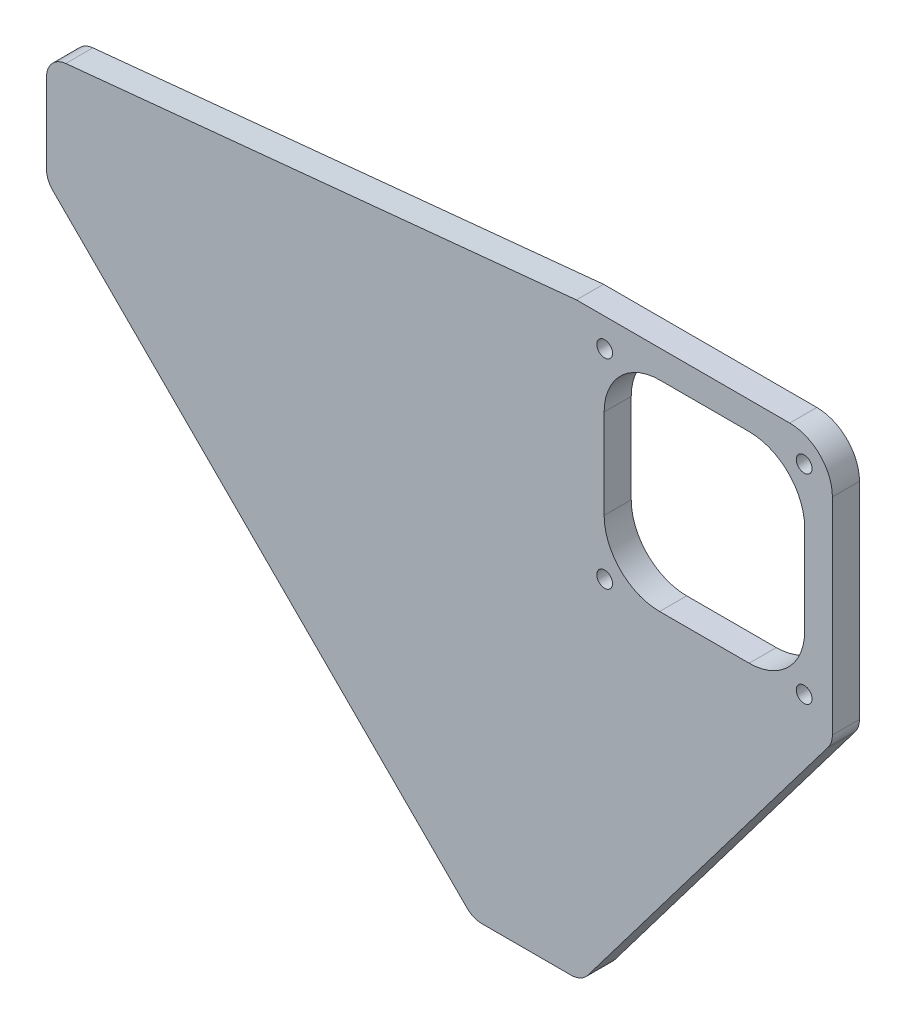
ISO-10303-21;
HEADER;
FILE_DESCRIPTION(('STEP AP214'),'2;1');
FILE_NAME('part.step','',(''),(''),'','','');
FILE_SCHEMA(('AUTOMOTIVE_DESIGN { 1 0 10303 214 1 1 1 1 }'));
ENDSEC;
DATA;
#1=APPLICATION_CONTEXT('core data for automotive mechanical design processes');
#2=APPLICATION_PROTOCOL_DEFINITION('international standard','automotive_design',2000,#1);
#3=PRODUCT_CONTEXT('',#1,'mechanical');
#4=PRODUCT('Part','Part','',(#3));
#5=PRODUCT_RELATED_PRODUCT_CATEGORY('part','',(#4));
#6=PRODUCT_DEFINITION_FORMATION('','',#4);
#7=PRODUCT_DEFINITION_CONTEXT('part definition',#1,'design');
#8=PRODUCT_DEFINITION('design','',#6,#7);
#9=PRODUCT_DEFINITION_SHAPE('','',#8);
#10=(LENGTH_UNIT() NAMED_UNIT(*) SI_UNIT(.MILLI.,.METRE.));
#11=(NAMED_UNIT(*) PLANE_ANGLE_UNIT() SI_UNIT($,.RADIAN.));
#12=(NAMED_UNIT(*) SI_UNIT($,.STERADIAN.) SOLID_ANGLE_UNIT());
#13=UNCERTAINTY_MEASURE_WITH_UNIT(LENGTH_MEASURE(1.E-05),#10,'distance_accuracy_value','');
#14=(GEOMETRIC_REPRESENTATION_CONTEXT(3) GLOBAL_UNCERTAINTY_ASSIGNED_CONTEXT((#13)) GLOBAL_UNIT_ASSIGNED_CONTEXT((#10,
#11,#12)) REPRESENTATION_CONTEXT('',''));
#15=CARTESIAN_POINT('',(0.,0.,0.));
#16=DIRECTION('',(0.,0.,1.));
#17=DIRECTION('',(1.,0.,0.));
#18=AXIS2_PLACEMENT_3D('',#15,#16,#17);
#19=CARTESIAN_POINT('',(-100.,25.4,6.35));
#20=DIRECTION('',(1.,0.,0.));
#21=DIRECTION('',(0.,0.,-1.));
#22=AXIS2_PLACEMENT_3D('',#19,#20,#21);
#23=PLANE('',#22);
#24=DIRECTION('',(0.,-1.,0.));
#25=VECTOR('',#24,1.);
#26=CARTESIAN_POINT('',(-100.,25.4,6.35));
#27=LINE('',#26,#25);
#28=CARTESIAN_POINT('',(-100.,20.8707096664379,6.35));
#29=VERTEX_POINT('',#28);
#30=CARTESIAN_POINT('',(-100.,2.07106781186547,6.35));
#31=VERTEX_POINT('',#30);
#32=EDGE_CURVE('E272',#29,#31,#27,.T.);
#33=ORIENTED_EDGE('',*,*,#32,.F.);
#34=DIRECTION('',(0.,0.,-1.));
#35=VECTOR('',#34,1.);
#36=CARTESIAN_POINT('',(-100.,20.8707096664379,6.35));
#37=LINE('',#36,#35);
#38=CARTESIAN_POINT('',(-100.,20.8707096664379,0.));
#39=VERTEX_POINT('',#38);
#40=EDGE_CURVE('E302',#29,#39,#37,.T.);
#41=ORIENTED_EDGE('',*,*,#40,.T.);
#42=DIRECTION('',(0.,-1.,0.));
#43=VECTOR('',#42,1.);
#44=CARTESIAN_POINT('',(-100.,25.4,0.));
#45=LINE('',#44,#43);
#46=CARTESIAN_POINT('',(-100.,2.07106781186547,0.));
#47=VERTEX_POINT('',#46);
#48=EDGE_CURVE('E271',#39,#47,#45,.T.);
#49=ORIENTED_EDGE('',*,*,#48,.T.);
#50=DIRECTION('',(0.,0.,-1.));
#51=VECTOR('',#50,1.);
#52=CARTESIAN_POINT('',(-100.,2.07106781186547,6.35));
#53=LINE('',#52,#51);
#54=EDGE_CURVE('E300',#47,#31,#53,.F.);
#55=ORIENTED_EDGE('',*,*,#54,.T.);
#56=EDGE_LOOP('',(#33,#41,#49,#55));
#57=FACE_BOUND('',#56,.T.);
#58=ADVANCED_FACE('F33',(#57),#23,.F.);
#59=CARTESIAN_POINT('',(-100.,0.,6.35));
#60=DIRECTION('',(0.707106781186548,0.707106781186548,0.));
#61=DIRECTION('',(-0.707106781186548,0.707106781186548,0.));
#62=AXIS2_PLACEMENT_3D('',#59,#60,#61);
#63=PLANE('',#62);
#64=DIRECTION('',(0.707106781186547,-0.707106781186547,0.));
#65=VECTOR('',#64,1.);
#66=CARTESIAN_POINT('',(-100.,0.,6.35));
#67=LINE('',#66,#65);
#68=CARTESIAN_POINT('',(-98.5355339059327,-1.46446609406727,6.35));
#69=VERTEX_POINT('',#68);
#70=CARTESIAN_POINT('',(-1.46446609406728,-98.5355339059327,6.35));
#71=VERTEX_POINT('',#70);
#72=EDGE_CURVE('E275',#69,#71,#67,.T.);
#73=ORIENTED_EDGE('',*,*,#72,.F.);
#74=DIRECTION('',(0.,0.,-1.));
#75=VECTOR('',#74,1.);
#76=CARTESIAN_POINT('',(-98.5355339059327,-1.46446609406727,6.35));
#77=LINE('',#76,#75);
#78=CARTESIAN_POINT('',(-98.5355339059327,-1.46446609406727,0.));
#79=VERTEX_POINT('',#78);
#80=EDGE_CURVE('E329',#69,#79,#77,.T.);
#81=ORIENTED_EDGE('',*,*,#80,.T.);
#82=DIRECTION('',(0.707106781186547,-0.707106781186547,0.));
#83=VECTOR('',#82,1.);
#84=CARTESIAN_POINT('',(-100.,0.,0.));
#85=LINE('',#84,#83);
#86=CARTESIAN_POINT('',(-1.46446609406728,-98.5355339059327,0.));
#87=VERTEX_POINT('',#86);
#88=EDGE_CURVE('E285',#79,#87,#85,.T.);
#89=ORIENTED_EDGE('',*,*,#88,.T.);
#90=DIRECTION('',(0.,0.,-1.));
#91=VECTOR('',#90,1.);
#92=CARTESIAN_POINT('',(-1.46446609406728,-98.5355339059327,6.35));
#93=LINE('',#92,#91);
#94=EDGE_CURVE('E327',#87,#71,#93,.F.);
#95=ORIENTED_EDGE('',*,*,#94,.T.);
#96=EDGE_LOOP('',(#73,#81,#89,#95));
#97=FACE_BOUND('',#96,.T.);
#98=ADVANCED_FACE('F372',(#97),#63,.F.);
#99=CARTESIAN_POINT('',(0.,-100.,6.35));
#100=DIRECTION('',(0.,1.,0.));
#101=DIRECTION('',(0.,0.,1.));
#102=AXIS2_PLACEMENT_3D('',#99,#100,#101);
#103=PLANE('',#102);
#104=DIRECTION('',(1.,0.,0.));
#105=VECTOR('',#104,1.);
#106=CARTESIAN_POINT('',(0.,-100.,6.35));
#107=LINE('',#106,#105);
#108=CARTESIAN_POINT('',(2.07106781186547,-100.,6.35));
#109=VERTEX_POINT('',#108);
#110=CARTESIAN_POINT('',(22.913455265881,-100.,6.35));
#111=VERTEX_POINT('',#110);
#112=EDGE_CURVE('E279',#109,#111,#107,.T.);
#113=ORIENTED_EDGE('',*,*,#112,.F.);
#114=DIRECTION('',(0.,0.,-1.));
#115=VECTOR('',#114,1.);
#116=CARTESIAN_POINT('',(2.07106781186547,-100.,6.35));
#117=LINE('',#116,#115);
#118=CARTESIAN_POINT('',(2.07106781186547,-100.,0.));
#119=VERTEX_POINT('',#118);
#120=EDGE_CURVE('E334',#109,#119,#117,.T.);
#121=ORIENTED_EDGE('',*,*,#120,.T.);
#122=DIRECTION('',(1.,0.,0.));
#123=VECTOR('',#122,1.);
#124=CARTESIAN_POINT('',(0.,-100.,0.));
#125=LINE('',#124,#123);
#126=CARTESIAN_POINT('',(22.913455265881,-100.,0.));
#127=VERTEX_POINT('',#126);
#128=EDGE_CURVE('E276',#119,#127,#125,.T.);
#129=ORIENTED_EDGE('',*,*,#128,.T.);
#130=DIRECTION('',(0.,0.,-1.));
#131=VECTOR('',#130,1.);
#132=CARTESIAN_POINT('',(22.913455265881,-100.,6.35));
#133=LINE('',#132,#131);
#134=EDGE_CURVE('E332',#127,#111,#133,.F.);
#135=ORIENTED_EDGE('',*,*,#134,.T.);
#136=EDGE_LOOP('',(#113,#121,#129,#135));
#137=FACE_BOUND('',#136,.T.);
#138=ADVANCED_FACE('F365',(#137),#103,.F.);
#139=CARTESIAN_POINT('',(0.,0.,6.35));
#140=DIRECTION('',(0.,0.,1.));
#141=DIRECTION('',(1.,0.,0.));
#142=AXIS2_PLACEMENT_3D('',#139,#140,#141);
#143=PLANE('',#142);
#144=CARTESIAN_POINT('',(77.5817279836453,-15.6782720163547,6.35));
#145=DIRECTION('',(0.,0.,-1.));
#146=DIRECTION('',(-1.,0.,0.));
#147=AXIS2_PLACEMENT_3D('',#144,#145,#146);
#148=CIRCLE('',#147,1.85);
#149=CARTESIAN_POINT('',(75.7317279836453,-15.6782720163547,6.35));
#150=VERTEX_POINT('',#149);
#151=EDGE_CURVE('E492',#150,#150,#148,.T.);
#152=ORIENTED_EDGE('',*,*,#151,.T.);
#153=EDGE_LOOP('',(#152));
#154=FACE_BOUND('',#153,.T.);
#155=CARTESIAN_POINT('',(77.5817279836453,31.0817279836453,6.35));
#156=DIRECTION('',(0.,0.,-1.));
#157=DIRECTION('',(-1.,0.,0.));
#158=AXIS2_PLACEMENT_3D('',#155,#156,#157);
#159=CIRCLE('',#158,1.85000000000001);
#160=CARTESIAN_POINT('',(75.7317279836453,31.0817279836453,6.35));
#161=VERTEX_POINT('',#160);
#162=EDGE_CURVE('E486',#161,#161,#159,.T.);
#163=ORIENTED_EDGE('',*,*,#162,.T.);
#164=EDGE_LOOP('',(#163));
#165=FACE_BOUND('',#164,.T.);
#166=CARTESIAN_POINT('',(30.8217279836453,31.0817279836453,6.35));
#167=DIRECTION('',(0.,0.,-1.));
#168=DIRECTION('',(-1.,0.,0.));
#169=AXIS2_PLACEMENT_3D('',#166,#167,#168);
#170=CIRCLE('',#169,1.85);
#171=CARTESIAN_POINT('',(28.9717279836453,31.0817279836453,6.35));
#172=VERTEX_POINT('',#171);
#173=EDGE_CURVE('E474',#172,#172,#170,.T.);
#174=ORIENTED_EDGE('',*,*,#173,.T.);
#175=EDGE_LOOP('',(#174));
#176=FACE_BOUND('',#175,.T.);
#177=CARTESIAN_POINT('',(30.8217279836453,-15.6782720163547,6.35));
#178=DIRECTION('',(0.,0.,-1.));
#179=DIRECTION('',(-1.,0.,0.));
#180=AXIS2_PLACEMENT_3D('',#177,#178,#179);
#181=CIRCLE('',#180,1.85);
#182=CARTESIAN_POINT('',(28.9717279836453,-15.6782720163547,6.35));
#183=VERTEX_POINT('',#182);
#184=EDGE_CURVE('E219',#183,#183,#181,.T.);
#185=ORIENTED_EDGE('',*,*,#184,.T.);
#186=EDGE_LOOP('',(#185));
#187=FACE_BOUND('',#186,.T.);
#188=CARTESIAN_POINT('',(43.7,-2.8,6.35));
#189=DIRECTION('',(0.,0.,1.));
#190=DIRECTION('',(1.,0.,0.));
#191=AXIS2_PLACEMENT_3D('',#188,#189,#190);
#192=CIRCLE('',#191,13.);
#193=CARTESIAN_POINT('',(30.7,-2.8,6.35));
#194=VERTEX_POINT('',#193);
#195=CARTESIAN_POINT('',(43.7,-15.8,6.35));
#196=VERTEX_POINT('',#195);
#197=EDGE_CURVE('E48',#194,#196,#192,.T.);
#198=ORIENTED_EDGE('',*,*,#197,.F.);
#199=DIRECTION('',(0.,-1.,0.));
#200=VECTOR('',#199,1.);
#201=CARTESIAN_POINT('',(30.7,18.2,6.35));
#202=LINE('',#201,#200);
#203=CARTESIAN_POINT('',(30.7,18.2,6.35));
#204=VERTEX_POINT('',#203);
#205=EDGE_CURVE('E195',#204,#194,#202,.T.);
#206=ORIENTED_EDGE('',*,*,#205,.F.);
#207=CARTESIAN_POINT('',(43.7,18.2,6.35));
#208=DIRECTION('',(0.,0.,1.));
#209=DIRECTION('',(1.,0.,0.));
#210=AXIS2_PLACEMENT_3D('',#207,#208,#209);
#211=CIRCLE('',#210,13.);
#212=CARTESIAN_POINT('',(43.7,31.2,6.35));
#213=VERTEX_POINT('',#212);
#214=EDGE_CURVE('E198',#213,#204,#211,.T.);
#215=ORIENTED_EDGE('',*,*,#214,.F.);
#216=DIRECTION('',(-1.,0.,0.));
#217=VECTOR('',#216,1.);
#218=CARTESIAN_POINT('',(43.7,31.2,6.35));
#219=LINE('',#218,#217);
#220=CARTESIAN_POINT('',(64.7,31.2,6.35));
#221=VERTEX_POINT('',#220);
#222=EDGE_CURVE('E230',#221,#213,#219,.T.);
#223=ORIENTED_EDGE('',*,*,#222,.F.);
#224=CARTESIAN_POINT('',(64.7,18.2,6.35));
#225=DIRECTION('',(0.,0.,1.));
#226=DIRECTION('',(-1.,0.,0.));
#227=AXIS2_PLACEMENT_3D('',#224,#225,#226);
#228=CIRCLE('',#227,13.);
#229=CARTESIAN_POINT('',(77.7,18.2,6.35));
#230=VERTEX_POINT('',#229);
#231=EDGE_CURVE('E227',#230,#221,#228,.T.);
#232=ORIENTED_EDGE('',*,*,#231,.F.);
#233=DIRECTION('',(0.,1.,0.));
#234=VECTOR('',#233,1.);
#235=CARTESIAN_POINT('',(77.7,18.2,6.35));
#236=LINE('',#235,#234);
#237=CARTESIAN_POINT('',(77.7,-2.8,6.35));
#238=VERTEX_POINT('',#237);
#239=EDGE_CURVE('E224',#238,#230,#236,.T.);
#240=ORIENTED_EDGE('',*,*,#239,.F.);
#241=CARTESIAN_POINT('',(64.7,-2.8,6.35));
#242=DIRECTION('',(0.,0.,1.));
#243=DIRECTION('',(1.,0.,0.));
#244=AXIS2_PLACEMENT_3D('',#241,#242,#243);
#245=CIRCLE('',#244,13.);
#246=CARTESIAN_POINT('',(64.7,-15.8,6.35));
#247=VERTEX_POINT('',#246);
#248=EDGE_CURVE('E221',#247,#238,#245,.T.);
#249=ORIENTED_EDGE('',*,*,#248,.F.);
#250=DIRECTION('',(1.,0.,0.));
#251=VECTOR('',#250,1.);
#252=CARTESIAN_POINT('',(43.7,-15.8,6.35));
#253=LINE('',#252,#251);
#254=EDGE_CURVE('E218',#196,#247,#253,.T.);
#255=ORIENTED_EDGE('',*,*,#254,.F.);
#256=EDGE_LOOP('',(#198,#206,#215,#223,#232,#240,#249,#255));
#257=FACE_BOUND('',#256,.T.);
#258=DIRECTION('',(-0.995131930887657,-0.0985517129623043,0.));
#259=VECTOR('',#258,1.);
#260=CARTESIAN_POINT('',(24.2,37.7,6.35));
#261=LINE('',#260,#259);
#262=CARTESIAN_POINT('',(24.2,37.7,6.35));
#263=VERTEX_POINT('',#262);
#264=CARTESIAN_POINT('',(-95.4927585648115,25.8463693208761,6.35));
#265=VERTEX_POINT('',#264);
#266=EDGE_CURVE('E257',#263,#265,#261,.T.);
#267=ORIENTED_EDGE('',*,*,#266,.T.);
#268=CARTESIAN_POINT('',(-95.,20.8707096664379,6.35));
#269=DIRECTION('',(0.,0.,1.));
#270=DIRECTION('',(1.,0.,0.));
#271=AXIS2_PLACEMENT_3D('',#268,#269,#270);
#272=CIRCLE('',#271,5.);
#273=EDGE_CURVE('E325',#265,#29,#272,.T.);
#274=ORIENTED_EDGE('',*,*,#273,.T.);
#275=ORIENTED_EDGE('',*,*,#32,.T.);
#276=CARTESIAN_POINT('',(-95.,2.07106781186547,6.35));
#277=DIRECTION('',(0.,0.,1.));
#278=DIRECTION('',(1.,0.,0.));
#279=AXIS2_PLACEMENT_3D('',#276,#277,#278);
#280=CIRCLE('',#279,5.);
#281=EDGE_CURVE('E323',#31,#69,#280,.T.);
#282=ORIENTED_EDGE('',*,*,#281,.T.);
#283=ORIENTED_EDGE('',*,*,#72,.T.);
#284=CARTESIAN_POINT('',(2.07106781186547,-95.,6.35));
#285=DIRECTION('',(0.,0.,1.));
#286=DIRECTION('',(1.,0.,0.));
#287=AXIS2_PLACEMENT_3D('',#284,#285,#286);
#288=CIRCLE('',#287,5.);
#289=EDGE_CURVE('E321',#71,#109,#288,.T.);
#290=ORIENTED_EDGE('',*,*,#289,.T.);
#291=ORIENTED_EDGE('',*,*,#112,.T.);
#292=CARTESIAN_POINT('',(22.913455265881,-95.,6.35));
#293=DIRECTION('',(0.,0.,1.));
#294=DIRECTION('',(1.,0.,0.));
#295=AXIS2_PLACEMENT_3D('',#292,#293,#294);
#296=CIRCLE('',#295,5.);
#297=CARTESIAN_POINT('',(26.9004871938926,-98.0172133509277,6.35));
#298=VERTEX_POINT('',#297);
#299=EDGE_CURVE('E319',#111,#298,#296,.T.);
#300=ORIENTED_EDGE('',*,*,#299,.T.);
#301=DIRECTION('',(0.603442670185537,0.797406385602316,0.));
#302=VECTOR('',#301,1.);
#303=CARTESIAN_POINT('',(84.2,-22.3,6.35));
#304=LINE('',#303,#302);
#305=CARTESIAN_POINT('',(83.1870319280116,-23.6385649522704,6.35));
#306=VERTEX_POINT('',#305);
#307=EDGE_CURVE('E249',#298,#306,#304,.T.);
#308=ORIENTED_EDGE('',*,*,#307,.T.);
#309=CARTESIAN_POINT('',(79.2,-20.6213516013427,6.35));
#310=DIRECTION('',(0.,0.,1.));
#311=DIRECTION('',(1.,0.,0.));
#312=AXIS2_PLACEMENT_3D('',#309,#310,#311);
#313=CIRCLE('',#312,5.);
#314=CARTESIAN_POINT('',(84.2,-20.6213516013427,6.35));
#315=VERTEX_POINT('',#314);
#316=EDGE_CURVE('E317',#306,#315,#313,.T.);
#317=ORIENTED_EDGE('',*,*,#316,.T.);
#318=DIRECTION('',(0.,1.,0.));
#319=VECTOR('',#318,1.);
#320=CARTESIAN_POINT('',(84.2,37.7,6.35));
#321=LINE('',#320,#319);
#322=CARTESIAN_POINT('',(84.2,27.7,6.35));
#323=VERTEX_POINT('',#322);
#324=EDGE_CURVE('E252',#315,#323,#321,.T.);
#325=ORIENTED_EDGE('',*,*,#324,.T.);
#326=CARTESIAN_POINT('',(74.2,27.7,6.35));
#327=DIRECTION('',(0.,0.,1.));
#328=DIRECTION('',(1.,0.,0.));
#329=AXIS2_PLACEMENT_3D('',#326,#327,#328);
#330=CIRCLE('',#329,10.);
#331=CARTESIAN_POINT('',(74.2,37.7,6.35));
#332=VERTEX_POINT('',#331);
#333=EDGE_CURVE('E298',#323,#332,#330,.T.);
#334=ORIENTED_EDGE('',*,*,#333,.T.);
#335=DIRECTION('',(-1.,0.,0.));
#336=VECTOR('',#335,1.);
#337=CARTESIAN_POINT('',(24.2,37.7,6.35));
#338=LINE('',#337,#336);
#339=EDGE_CURVE('E255',#332,#263,#338,.T.);
#340=ORIENTED_EDGE('',*,*,#339,.T.);
#341=EDGE_LOOP('',(#267,#274,#275,#282,#283,#290,#291,#300,#308,#317,#325,#334,#340));
#342=FACE_BOUND('',#341,.T.);
#343=ADVANCED_FACE('F359',(#154,#165,#176,#187,#257,#342),#143,.T.);
#344=CARTESIAN_POINT('',(0.,0.,0.));
#345=DIRECTION('',(0.,0.,1.));
#346=DIRECTION('',(1.,0.,0.));
#347=AXIS2_PLACEMENT_3D('',#344,#345,#346);
#348=PLANE('',#347);
#349=CARTESIAN_POINT('',(77.5817279836453,-15.6782720163547,0.));
#350=DIRECTION('',(0.,0.,-1.));
#351=DIRECTION('',(-1.,0.,0.));
#352=AXIS2_PLACEMENT_3D('',#349,#350,#351);
#353=CIRCLE('',#352,1.85);
#354=CARTESIAN_POINT('',(75.7317279836453,-15.6782720163547,0.));
#355=VERTEX_POINT('',#354);
#356=EDGE_CURVE('E489',#355,#355,#353,.T.);
#357=ORIENTED_EDGE('',*,*,#356,.F.);
#358=EDGE_LOOP('',(#357));
#359=FACE_BOUND('',#358,.T.);
#360=CARTESIAN_POINT('',(77.5817279836453,31.0817279836453,0.));
#361=DIRECTION('',(0.,0.,-1.));
#362=DIRECTION('',(-1.,0.,0.));
#363=AXIS2_PLACEMENT_3D('',#360,#361,#362);
#364=CIRCLE('',#363,1.85000000000001);
#365=CARTESIAN_POINT('',(75.7317279836453,31.0817279836453,0.));
#366=VERTEX_POINT('',#365);
#367=EDGE_CURVE('E481',#366,#366,#364,.T.);
#368=ORIENTED_EDGE('',*,*,#367,.F.);
#369=EDGE_LOOP('',(#368));
#370=FACE_BOUND('',#369,.T.);
#371=CARTESIAN_POINT('',(30.8217279836453,31.0817279836453,0.));
#372=DIRECTION('',(0.,0.,-1.));
#373=DIRECTION('',(-1.,0.,0.));
#374=AXIS2_PLACEMENT_3D('',#371,#372,#373);
#375=CIRCLE('',#374,1.85);
#376=CARTESIAN_POINT('',(28.9717279836453,31.0817279836453,0.));
#377=VERTEX_POINT('',#376);
#378=EDGE_CURVE('E477',#377,#377,#375,.T.);
#379=ORIENTED_EDGE('',*,*,#378,.F.);
#380=EDGE_LOOP('',(#379));
#381=FACE_BOUND('',#380,.T.);
#382=CARTESIAN_POINT('',(30.8217279836453,-15.6782720163547,0.));
#383=DIRECTION('',(0.,0.,-1.));
#384=DIRECTION('',(-1.,0.,0.));
#385=AXIS2_PLACEMENT_3D('',#382,#383,#384);
#386=CIRCLE('',#385,1.85);
#387=CARTESIAN_POINT('',(28.9717279836453,-15.6782720163547,0.));
#388=VERTEX_POINT('',#387);
#389=EDGE_CURVE('E201',#388,#388,#386,.T.);
#390=ORIENTED_EDGE('',*,*,#389,.F.);
#391=EDGE_LOOP('',(#390));
#392=FACE_BOUND('',#391,.T.);
#393=DIRECTION('',(0.,-1.,0.));
#394=VECTOR('',#393,1.);
#395=CARTESIAN_POINT('',(30.7,18.2,0.));
#396=LINE('',#395,#394);
#397=CARTESIAN_POINT('',(30.7,18.2,0.));
#398=VERTEX_POINT('',#397);
#399=CARTESIAN_POINT('',(30.7,-2.8,0.));
#400=VERTEX_POINT('',#399);
#401=EDGE_CURVE('E184',#398,#400,#396,.T.);
#402=ORIENTED_EDGE('',*,*,#401,.T.);
#403=CARTESIAN_POINT('',(43.7,-2.8,0.));
#404=DIRECTION('',(0.,0.,1.));
#405=DIRECTION('',(1.,0.,0.));
#406=AXIS2_PLACEMENT_3D('',#403,#404,#405);
#407=CIRCLE('',#406,13.);
#408=CARTESIAN_POINT('',(43.7,-15.8,0.));
#409=VERTEX_POINT('',#408);
#410=EDGE_CURVE('E178',#400,#409,#407,.T.);
#411=ORIENTED_EDGE('',*,*,#410,.T.);
#412=DIRECTION('',(1.,0.,0.));
#413=VECTOR('',#412,1.);
#414=CARTESIAN_POINT('',(43.7,-15.8,0.));
#415=LINE('',#414,#413);
#416=CARTESIAN_POINT('',(64.7,-15.8,0.));
#417=VERTEX_POINT('',#416);
#418=EDGE_CURVE('E187',#409,#417,#415,.T.);
#419=ORIENTED_EDGE('',*,*,#418,.T.);
#420=CARTESIAN_POINT('',(64.7,-2.8,0.));
#421=DIRECTION('',(0.,0.,1.));
#422=DIRECTION('',(1.,0.,0.));
#423=AXIS2_PLACEMENT_3D('',#420,#421,#422);
#424=CIRCLE('',#423,13.);
#425=CARTESIAN_POINT('',(77.7,-2.8,0.));
#426=VERTEX_POINT('',#425);
#427=EDGE_CURVE('E56',#417,#426,#424,.T.);
#428=ORIENTED_EDGE('',*,*,#427,.T.);
#429=DIRECTION('',(0.,1.,0.));
#430=VECTOR('',#429,1.);
#431=CARTESIAN_POINT('',(77.7,18.2,0.));
#432=LINE('',#431,#430);
#433=CARTESIAN_POINT('',(77.7,18.2,0.));
#434=VERTEX_POINT('',#433);
#435=EDGE_CURVE('E205',#426,#434,#432,.T.);
#436=ORIENTED_EDGE('',*,*,#435,.T.);
#437=CARTESIAN_POINT('',(64.7,18.2,0.));
#438=DIRECTION('',(0.,0.,1.));
#439=DIRECTION('',(-1.,0.,0.));
#440=AXIS2_PLACEMENT_3D('',#437,#438,#439);
#441=CIRCLE('',#440,13.);
#442=CARTESIAN_POINT('',(64.7,31.2,0.));
#443=VERTEX_POINT('',#442);
#444=EDGE_CURVE('E208',#434,#443,#441,.T.);
#445=ORIENTED_EDGE('',*,*,#444,.T.);
#446=DIRECTION('',(-1.,0.,0.));
#447=VECTOR('',#446,1.);
#448=CARTESIAN_POINT('',(43.7,31.2,0.));
#449=LINE('',#448,#447);
#450=CARTESIAN_POINT('',(43.7,31.2,0.));
#451=VERTEX_POINT('',#450);
#452=EDGE_CURVE('E211',#443,#451,#449,.T.);
#453=ORIENTED_EDGE('',*,*,#452,.T.);
#454=CARTESIAN_POINT('',(43.7,18.2,0.));
#455=DIRECTION('',(0.,0.,1.));
#456=DIRECTION('',(1.,0.,0.));
#457=AXIS2_PLACEMENT_3D('',#454,#455,#456);
#458=CIRCLE('',#457,13.);
#459=EDGE_CURVE('E214',#451,#398,#458,.T.);
#460=ORIENTED_EDGE('',*,*,#459,.T.);
#461=EDGE_LOOP('',(#402,#411,#419,#428,#436,#445,#453,#460));
#462=FACE_BOUND('',#461,.T.);
#463=ORIENTED_EDGE('',*,*,#48,.F.);
#464=CARTESIAN_POINT('',(-95.,20.8707096664379,0.));
#465=DIRECTION('',(0.,0.,1.));
#466=DIRECTION('',(1.,0.,0.));
#467=AXIS2_PLACEMENT_3D('',#464,#465,#466);
#468=CIRCLE('',#467,5.);
#469=CARTESIAN_POINT('',(-95.4927585648115,25.8463693208761,0.));
#470=VERTEX_POINT('',#469);
#471=EDGE_CURVE('E313',#39,#470,#468,.F.);
#472=ORIENTED_EDGE('',*,*,#471,.T.);
#473=DIRECTION('',(-0.995131930887657,-0.0985517129623043,0.));
#474=VECTOR('',#473,1.);
#475=CARTESIAN_POINT('',(24.2,37.7,0.));
#476=LINE('',#475,#474);
#477=CARTESIAN_POINT('',(24.2,37.7,0.));
#478=VERTEX_POINT('',#477);
#479=EDGE_CURVE('E253',#478,#470,#476,.T.);
#480=ORIENTED_EDGE('',*,*,#479,.F.);
#481=DIRECTION('',(-1.,0.,0.));
#482=VECTOR('',#481,1.);
#483=CARTESIAN_POINT('',(24.2,37.7,0.));
#484=LINE('',#483,#482);
#485=CARTESIAN_POINT('',(74.2,37.7,0.));
#486=VERTEX_POINT('',#485);
#487=EDGE_CURVE('E265',#486,#478,#484,.T.);
#488=ORIENTED_EDGE('',*,*,#487,.F.);
#489=CARTESIAN_POINT('',(74.2,27.7,0.));
#490=DIRECTION('',(0.,0.,1.));
#491=DIRECTION('',(1.,0.,0.));
#492=AXIS2_PLACEMENT_3D('',#489,#490,#491);
#493=CIRCLE('',#492,10.);
#494=CARTESIAN_POINT('',(84.2,27.7,0.));
#495=VERTEX_POINT('',#494);
#496=EDGE_CURVE('E292',#486,#495,#493,.F.);
#497=ORIENTED_EDGE('',*,*,#496,.T.);
#498=DIRECTION('',(0.,1.,0.));
#499=VECTOR('',#498,1.);
#500=CARTESIAN_POINT('',(84.2,37.7,0.));
#501=LINE('',#500,#499);
#502=CARTESIAN_POINT('',(84.2,-20.6213516013427,0.));
#503=VERTEX_POINT('',#502);
#504=EDGE_CURVE('E263',#503,#495,#501,.T.);
#505=ORIENTED_EDGE('',*,*,#504,.F.);
#506=CARTESIAN_POINT('',(79.2,-20.6213516013427,0.));
#507=DIRECTION('',(0.,0.,1.));
#508=DIRECTION('',(1.,0.,0.));
#509=AXIS2_PLACEMENT_3D('',#506,#507,#508);
#510=CIRCLE('',#509,5.);
#511=CARTESIAN_POINT('',(83.1870319280116,-23.6385649522704,0.));
#512=VERTEX_POINT('',#511);
#513=EDGE_CURVE('E305',#503,#512,#510,.F.);
#514=ORIENTED_EDGE('',*,*,#513,.T.);
#515=DIRECTION('',(0.603442670185537,0.797406385602316,0.));
#516=VECTOR('',#515,1.);
#517=CARTESIAN_POINT('',(84.2,-22.3,0.));
#518=LINE('',#517,#516);
#519=CARTESIAN_POINT('',(26.9004871938926,-98.0172133509277,0.));
#520=VERTEX_POINT('',#519);
#521=EDGE_CURVE('E237',#520,#512,#518,.T.);
#522=ORIENTED_EDGE('',*,*,#521,.F.);
#523=CARTESIAN_POINT('',(22.913455265881,-95.,0.));
#524=DIRECTION('',(0.,0.,1.));
#525=DIRECTION('',(1.,0.,0.));
#526=AXIS2_PLACEMENT_3D('',#523,#524,#525);
#527=CIRCLE('',#526,5.);
#528=EDGE_CURVE('E307',#520,#127,#527,.F.);
#529=ORIENTED_EDGE('',*,*,#528,.T.);
#530=ORIENTED_EDGE('',*,*,#128,.F.);
#531=CARTESIAN_POINT('',(2.07106781186547,-95.,0.));
#532=DIRECTION('',(0.,0.,1.));
#533=DIRECTION('',(1.,0.,0.));
#534=AXIS2_PLACEMENT_3D('',#531,#532,#533);
#535=CIRCLE('',#534,5.);
#536=EDGE_CURVE('E309',#119,#87,#535,.F.);
#537=ORIENTED_EDGE('',*,*,#536,.T.);
#538=ORIENTED_EDGE('',*,*,#88,.F.);
#539=CARTESIAN_POINT('',(-95.,2.07106781186547,0.));
#540=DIRECTION('',(0.,0.,1.));
#541=DIRECTION('',(1.,0.,0.));
#542=AXIS2_PLACEMENT_3D('',#539,#540,#541);
#543=CIRCLE('',#542,5.);
#544=EDGE_CURVE('E311',#79,#47,#543,.F.);
#545=ORIENTED_EDGE('',*,*,#544,.T.);
#546=EDGE_LOOP('',(#463,#472,#480,#488,#497,#505,#514,#522,#529,#530,#537,#538,#545));
#547=FACE_BOUND('',#546,.T.);
#548=ADVANCED_FACE('F191',(#359,#370,#381,#392,#462,#547),#348,.F.);
#549=CARTESIAN_POINT('',(84.2,-22.3,6.35));
#550=DIRECTION('',(-0.797406385602316,0.603442670185536,0.));
#551=DIRECTION('',(-0.603442670185537,-0.797406385602316,0.));
#552=AXIS2_PLACEMENT_3D('',#549,#550,#551);
#553=PLANE('',#552);
#554=ORIENTED_EDGE('',*,*,#307,.F.);
#555=DIRECTION('',(0.,0.,-1.));
#556=VECTOR('',#555,1.);
#557=CARTESIAN_POINT('',(26.9004871938926,-98.0172133509277,6.35));
#558=LINE('',#557,#556);
#559=EDGE_CURVE('E41',#298,#520,#558,.T.);
#560=ORIENTED_EDGE('',*,*,#559,.T.);
#561=ORIENTED_EDGE('',*,*,#521,.T.);
#562=DIRECTION('',(0.,0.,-1.));
#563=VECTOR('',#562,1.);
#564=CARTESIAN_POINT('',(83.1870319280116,-23.6385649522704,6.35));
#565=LINE('',#564,#563);
#566=EDGE_CURVE('E337',#512,#306,#565,.F.);
#567=ORIENTED_EDGE('',*,*,#566,.T.);
#568=EDGE_LOOP('',(#554,#560,#561,#567));
#569=FACE_BOUND('',#568,.T.);
#570=ADVANCED_FACE('F343',(#569),#553,.F.);
#571=CARTESIAN_POINT('',(84.2,37.7,6.35));
#572=DIRECTION('',(-1.,0.,0.));
#573=DIRECTION('',(0.,-1.,0.));
#574=AXIS2_PLACEMENT_3D('',#571,#572,#573);
#575=PLANE('',#574);
#576=ORIENTED_EDGE('',*,*,#324,.F.);
#577=DIRECTION('',(0.,0.,-1.));
#578=VECTOR('',#577,1.);
#579=CARTESIAN_POINT('',(84.2,-20.6213516013427,6.35));
#580=LINE('',#579,#578);
#581=EDGE_CURVE('E11',#315,#503,#580,.T.);
#582=ORIENTED_EDGE('',*,*,#581,.T.);
#583=ORIENTED_EDGE('',*,*,#504,.T.);
#584=DIRECTION('',(0.,0.,-1.));
#585=VECTOR('',#584,1.);
#586=CARTESIAN_POINT('',(84.2,27.7,6.35));
#587=LINE('',#586,#585);
#588=EDGE_CURVE('E295',#495,#323,#587,.F.);
#589=ORIENTED_EDGE('',*,*,#588,.T.);
#590=EDGE_LOOP('',(#576,#582,#583,#589));
#591=FACE_BOUND('',#590,.T.);
#592=ADVANCED_FACE('F355',(#591),#575,.F.);
#593=CARTESIAN_POINT('',(24.2,37.7,6.35));
#594=DIRECTION('',(0.,-1.,0.));
#595=DIRECTION('',(1.,0.,0.));
#596=AXIS2_PLACEMENT_3D('',#593,#594,#595);
#597=PLANE('',#596);
#598=ORIENTED_EDGE('',*,*,#339,.F.);
#599=DIRECTION('',(0.,0.,-1.));
#600=VECTOR('',#599,1.);
#601=CARTESIAN_POINT('',(74.2,37.7,6.35));
#602=LINE('',#601,#600);
#603=EDGE_CURVE('E282',#332,#486,#602,.T.);
#604=ORIENTED_EDGE('',*,*,#603,.T.);
#605=ORIENTED_EDGE('',*,*,#487,.T.);
#606=DIRECTION('',(0.,0.,-1.));
#607=VECTOR('',#606,1.);
#608=CARTESIAN_POINT('',(24.2,37.7,6.35));
#609=LINE('',#608,#607);
#610=EDGE_CURVE('E260',#263,#478,#609,.T.);
#611=ORIENTED_EDGE('',*,*,#610,.F.);
#612=EDGE_LOOP('',(#598,#604,#605,#611));
#613=FACE_BOUND('',#612,.T.);
#614=ADVANCED_FACE('F394',(#613),#597,.F.);
#615=CARTESIAN_POINT('',(24.2,37.7,6.35));
#616=DIRECTION('',(0.0985517129623043,-0.995131930887657,0.));
#617=DIRECTION('',(0.995131930887657,0.0985517129623043,0.));
#618=AXIS2_PLACEMENT_3D('',#615,#616,#617);
#619=PLANE('',#618);
#620=ORIENTED_EDGE('',*,*,#479,.T.);
#621=DIRECTION('',(0.,0.,-1.));
#622=VECTOR('',#621,1.);
#623=CARTESIAN_POINT('',(-95.4927585648115,25.8463693208761,6.35));
#624=LINE('',#623,#622);
#625=EDGE_CURVE('E315',#470,#265,#624,.F.);
#626=ORIENTED_EDGE('',*,*,#625,.T.);
#627=ORIENTED_EDGE('',*,*,#266,.F.);
#628=ORIENTED_EDGE('',*,*,#610,.T.);
#629=EDGE_LOOP('',(#620,#626,#627,#628));
#630=FACE_BOUND('',#629,.T.);
#631=ADVANCED_FACE('F390',(#630),#619,.F.);
#632=CARTESIAN_POINT('',(74.2,27.7,6.35));
#633=DIRECTION('',(0.,0.,-1.));
#634=DIRECTION('',(-1.,0.,0.));
#635=AXIS2_PLACEMENT_3D('',#632,#633,#634);
#636=CYLINDRICAL_SURFACE('',#635,10.);
#637=ORIENTED_EDGE('',*,*,#333,.F.);
#638=ORIENTED_EDGE('',*,*,#588,.F.);
#639=ORIENTED_EDGE('',*,*,#496,.F.);
#640=ORIENTED_EDGE('',*,*,#603,.F.);
#641=EDGE_LOOP('',(#637,#638,#639,#640));
#642=FACE_BOUND('',#641,.T.);
#643=ADVANCED_FACE('F397',(#642),#636,.T.);
#644=CARTESIAN_POINT('',(-95.,20.8707096664379,6.35));
#645=DIRECTION('',(0.,0.,-1.));
#646=DIRECTION('',(-1.,0.,0.));
#647=AXIS2_PLACEMENT_3D('',#644,#645,#646);
#648=CYLINDRICAL_SURFACE('',#647,5.);
#649=ORIENTED_EDGE('',*,*,#273,.F.);
#650=ORIENTED_EDGE('',*,*,#625,.F.);
#651=ORIENTED_EDGE('',*,*,#471,.F.);
#652=ORIENTED_EDGE('',*,*,#40,.F.);
#653=EDGE_LOOP('',(#649,#650,#651,#652));
#654=FACE_BOUND('',#653,.T.);
#655=ADVANCED_FACE('F385',(#654),#648,.T.);
#656=CARTESIAN_POINT('',(-95.,2.07106781186547,6.35));
#657=DIRECTION('',(0.,0.,-1.));
#658=DIRECTION('',(-1.,0.,0.));
#659=AXIS2_PLACEMENT_3D('',#656,#657,#658);
#660=CYLINDRICAL_SURFACE('',#659,5.);
#661=ORIENTED_EDGE('',*,*,#281,.F.);
#662=ORIENTED_EDGE('',*,*,#54,.F.);
#663=ORIENTED_EDGE('',*,*,#544,.F.);
#664=ORIENTED_EDGE('',*,*,#80,.F.);
#665=EDGE_LOOP('',(#661,#662,#663,#664));
#666=FACE_BOUND('',#665,.T.);
#667=ADVANCED_FACE('F378',(#666),#660,.T.);
#668=CARTESIAN_POINT('',(2.07106781186547,-95.,6.35));
#669=DIRECTION('',(0.,0.,-1.));
#670=DIRECTION('',(-1.,0.,0.));
#671=AXIS2_PLACEMENT_3D('',#668,#669,#670);
#672=CYLINDRICAL_SURFACE('',#671,5.);
#673=ORIENTED_EDGE('',*,*,#289,.F.);
#674=ORIENTED_EDGE('',*,*,#94,.F.);
#675=ORIENTED_EDGE('',*,*,#536,.F.);
#676=ORIENTED_EDGE('',*,*,#120,.F.);
#677=EDGE_LOOP('',(#673,#674,#675,#676));
#678=FACE_BOUND('',#677,.T.);
#679=ADVANCED_FACE('F375',(#678),#672,.T.);
#680=CARTESIAN_POINT('',(22.913455265881,-95.,6.35));
#681=DIRECTION('',(0.,0.,-1.));
#682=DIRECTION('',(-1.,0.,0.));
#683=AXIS2_PLACEMENT_3D('',#680,#681,#682);
#684=CYLINDRICAL_SURFACE('',#683,5.);
#685=ORIENTED_EDGE('',*,*,#299,.F.);
#686=ORIENTED_EDGE('',*,*,#134,.F.);
#687=ORIENTED_EDGE('',*,*,#528,.F.);
#688=ORIENTED_EDGE('',*,*,#559,.F.);
#689=EDGE_LOOP('',(#685,#686,#687,#688));
#690=FACE_BOUND('',#689,.T.);
#691=ADVANCED_FACE('F363',(#690),#684,.T.);
#692=CARTESIAN_POINT('',(79.2,-20.6213516013427,6.35));
#693=DIRECTION('',(0.,0.,-1.));
#694=DIRECTION('',(-1.,0.,0.));
#695=AXIS2_PLACEMENT_3D('',#692,#693,#694);
#696=CYLINDRICAL_SURFACE('',#695,5.);
#697=ORIENTED_EDGE('',*,*,#316,.F.);
#698=ORIENTED_EDGE('',*,*,#566,.F.);
#699=ORIENTED_EDGE('',*,*,#513,.F.);
#700=ORIENTED_EDGE('',*,*,#581,.F.);
#701=EDGE_LOOP('',(#697,#698,#699,#700));
#702=FACE_BOUND('',#701,.T.);
#703=ADVANCED_FACE('F35',(#702),#696,.T.);
#704=CARTESIAN_POINT('',(43.7,-2.8,0.));
#705=DIRECTION('',(0.,0.,1.));
#706=DIRECTION('',(1.,0.,0.));
#707=AXIS2_PLACEMENT_3D('',#704,#705,#706);
#708=CYLINDRICAL_SURFACE('',#707,13.);
#709=ORIENTED_EDGE('',*,*,#197,.T.);
#710=DIRECTION('',(0.,0.,1.));
#711=VECTOR('',#710,1.);
#712=CARTESIAN_POINT('',(43.7,-15.8,0.));
#713=LINE('',#712,#711);
#714=EDGE_CURVE('E174',#409,#196,#713,.T.);
#715=ORIENTED_EDGE('',*,*,#714,.F.);
#716=ORIENTED_EDGE('',*,*,#410,.F.);
#717=DIRECTION('',(0.,0.,1.));
#718=VECTOR('',#717,1.);
#719=CARTESIAN_POINT('',(30.7,-2.8,0.));
#720=LINE('',#719,#718);
#721=EDGE_CURVE('E235',#400,#194,#720,.T.);
#722=ORIENTED_EDGE('',*,*,#721,.T.);
#723=EDGE_LOOP('',(#709,#715,#716,#722));
#724=FACE_BOUND('',#723,.T.);
#725=ADVANCED_FACE('F176',(#724),#708,.F.);
#726=CARTESIAN_POINT('',(30.7,18.2,0.));
#727=DIRECTION('',(-1.,0.,0.));
#728=DIRECTION('',(0.,-1.,0.));
#729=AXIS2_PLACEMENT_3D('',#726,#727,#728);
#730=PLANE('',#729);
#731=ORIENTED_EDGE('',*,*,#205,.T.);
#732=ORIENTED_EDGE('',*,*,#721,.F.);
#733=ORIENTED_EDGE('',*,*,#401,.F.);
#734=DIRECTION('',(0.,0.,1.));
#735=VECTOR('',#734,1.);
#736=CARTESIAN_POINT('',(30.7,18.2,0.));
#737=LINE('',#736,#735);
#738=EDGE_CURVE('E238',#398,#204,#737,.T.);
#739=ORIENTED_EDGE('',*,*,#738,.T.);
#740=EDGE_LOOP('',(#731,#732,#733,#739));
#741=FACE_BOUND('',#740,.T.);
#742=ADVANCED_FACE('F429',(#741),#730,.F.);
#743=CARTESIAN_POINT('',(43.7,18.2,0.));
#744=DIRECTION('',(0.,0.,1.));
#745=DIRECTION('',(1.,0.,0.));
#746=AXIS2_PLACEMENT_3D('',#743,#744,#745);
#747=CYLINDRICAL_SURFACE('',#746,13.);
#748=ORIENTED_EDGE('',*,*,#214,.T.);
#749=ORIENTED_EDGE('',*,*,#738,.F.);
#750=ORIENTED_EDGE('',*,*,#459,.F.);
#751=DIRECTION('',(0.,0.,1.));
#752=VECTOR('',#751,1.);
#753=CARTESIAN_POINT('',(43.7,31.2,0.));
#754=LINE('',#753,#752);
#755=EDGE_CURVE('E240',#451,#213,#754,.T.);
#756=ORIENTED_EDGE('',*,*,#755,.T.);
#757=EDGE_LOOP('',(#748,#749,#750,#756));
#758=FACE_BOUND('',#757,.T.);
#759=ADVANCED_FACE('F447',(#758),#747,.F.);
#760=CARTESIAN_POINT('',(43.7,31.2,0.));
#761=DIRECTION('',(0.,1.,0.));
#762=DIRECTION('',(-1.,0.,0.));
#763=AXIS2_PLACEMENT_3D('',#760,#761,#762);
#764=PLANE('',#763);
#765=ORIENTED_EDGE('',*,*,#222,.T.);
#766=ORIENTED_EDGE('',*,*,#755,.F.);
#767=ORIENTED_EDGE('',*,*,#452,.F.);
#768=DIRECTION('',(0.,0.,1.));
#769=VECTOR('',#768,1.);
#770=CARTESIAN_POINT('',(64.7,31.2,0.));
#771=LINE('',#770,#769);
#772=EDGE_CURVE('E242',#443,#221,#771,.T.);
#773=ORIENTED_EDGE('',*,*,#772,.T.);
#774=EDGE_LOOP('',(#765,#766,#767,#773));
#775=FACE_BOUND('',#774,.T.);
#776=ADVANCED_FACE('F443',(#775),#764,.F.);
#777=CARTESIAN_POINT('',(64.7,18.2,0.));
#778=DIRECTION('',(0.,0.,1.));
#779=DIRECTION('',(1.,0.,0.));
#780=AXIS2_PLACEMENT_3D('',#777,#778,#779);
#781=CYLINDRICAL_SURFACE('',#780,13.);
#782=ORIENTED_EDGE('',*,*,#231,.T.);
#783=ORIENTED_EDGE('',*,*,#772,.F.);
#784=ORIENTED_EDGE('',*,*,#444,.F.);
#785=DIRECTION('',(0.,0.,1.));
#786=VECTOR('',#785,1.);
#787=CARTESIAN_POINT('',(77.7,18.2,0.));
#788=LINE('',#787,#786);
#789=EDGE_CURVE('E244',#434,#230,#788,.T.);
#790=ORIENTED_EDGE('',*,*,#789,.T.);
#791=EDGE_LOOP('',(#782,#783,#784,#790));
#792=FACE_BOUND('',#791,.T.);
#793=ADVANCED_FACE('F439',(#792),#781,.F.);
#794=CARTESIAN_POINT('',(77.7,18.2,0.));
#795=DIRECTION('',(1.,0.,0.));
#796=DIRECTION('',(0.,1.,0.));
#797=AXIS2_PLACEMENT_3D('',#794,#795,#796);
#798=PLANE('',#797);
#799=ORIENTED_EDGE('',*,*,#239,.T.);
#800=ORIENTED_EDGE('',*,*,#789,.F.);
#801=ORIENTED_EDGE('',*,*,#435,.F.);
#802=DIRECTION('',(0.,0.,1.));
#803=VECTOR('',#802,1.);
#804=CARTESIAN_POINT('',(77.7,-2.8,0.));
#805=LINE('',#804,#803);
#806=EDGE_CURVE('E246',#426,#238,#805,.T.);
#807=ORIENTED_EDGE('',*,*,#806,.T.);
#808=EDGE_LOOP('',(#799,#800,#801,#807));
#809=FACE_BOUND('',#808,.T.);
#810=ADVANCED_FACE('F436',(#809),#798,.F.);
#811=CARTESIAN_POINT('',(64.7,-2.8,0.));
#812=DIRECTION('',(0.,0.,1.));
#813=DIRECTION('',(1.,0.,0.));
#814=AXIS2_PLACEMENT_3D('',#811,#812,#813);
#815=CYLINDRICAL_SURFACE('',#814,13.);
#816=ORIENTED_EDGE('',*,*,#248,.T.);
#817=ORIENTED_EDGE('',*,*,#806,.F.);
#818=ORIENTED_EDGE('',*,*,#427,.F.);
#819=DIRECTION('',(0.,0.,1.));
#820=VECTOR('',#819,1.);
#821=CARTESIAN_POINT('',(64.7,-15.8,0.));
#822=LINE('',#821,#820);
#823=EDGE_CURVE('E183',#417,#247,#822,.T.);
#824=ORIENTED_EDGE('',*,*,#823,.T.);
#825=EDGE_LOOP('',(#816,#817,#818,#824));
#826=FACE_BOUND('',#825,.T.);
#827=ADVANCED_FACE('F433',(#826),#815,.F.);
#828=CARTESIAN_POINT('',(43.7,-15.8,0.));
#829=DIRECTION('',(0.,-1.,0.));
#830=DIRECTION('',(0.,0.,-1.));
#831=AXIS2_PLACEMENT_3D('',#828,#829,#830);
#832=PLANE('',#831);
#833=ORIENTED_EDGE('',*,*,#254,.T.);
#834=ORIENTED_EDGE('',*,*,#823,.F.);
#835=ORIENTED_EDGE('',*,*,#418,.F.);
#836=ORIENTED_EDGE('',*,*,#714,.T.);
#837=EDGE_LOOP('',(#833,#834,#835,#836));
#838=FACE_BOUND('',#837,.T.);
#839=ADVANCED_FACE('F188',(#838),#832,.F.);
#840=CARTESIAN_POINT('',(30.8217279836453,-15.6782720163547,6.35));
#841=DIRECTION('',(0.,0.,-1.));
#842=DIRECTION('',(-1.,0.,0.));
#843=AXIS2_PLACEMENT_3D('',#840,#841,#842);
#844=CYLINDRICAL_SURFACE('',#843,1.85);
#845=ORIENTED_EDGE('',*,*,#184,.F.);
#846=EDGE_LOOP('',(#845));
#847=FACE_BOUND('',#846,.T.);
#848=ORIENTED_EDGE('',*,*,#389,.T.);
#849=EDGE_LOOP('',(#848));
#850=FACE_BOUND('',#849,.T.);
#851=ADVANCED_FACE('F432',(#847,#850),#844,.F.);
#852=CARTESIAN_POINT('',(30.8217279836453,31.0817279836453,6.35));
#853=DIRECTION('',(0.,0.,-1.));
#854=DIRECTION('',(-1.,0.,0.));
#855=AXIS2_PLACEMENT_3D('',#852,#853,#854);
#856=CYLINDRICAL_SURFACE('',#855,1.85);
#857=ORIENTED_EDGE('',*,*,#173,.F.);
#858=EDGE_LOOP('',(#857));
#859=FACE_BOUND('',#858,.T.);
#860=ORIENTED_EDGE('',*,*,#378,.T.);
#861=EDGE_LOOP('',(#860));
#862=FACE_BOUND('',#861,.T.);
#863=ADVANCED_FACE('F457',(#859,#862),#856,.F.);
#864=CARTESIAN_POINT('',(77.5817279836453,31.0817279836453,6.35));
#865=DIRECTION('',(0.,0.,-1.));
#866=DIRECTION('',(-1.,0.,0.));
#867=AXIS2_PLACEMENT_3D('',#864,#865,#866);
#868=CYLINDRICAL_SURFACE('',#867,1.85000000000001);
#869=ORIENTED_EDGE('',*,*,#162,.F.);
#870=EDGE_LOOP('',(#869));
#871=FACE_BOUND('',#870,.T.);
#872=ORIENTED_EDGE('',*,*,#367,.T.);
#873=EDGE_LOOP('',(#872));
#874=FACE_BOUND('',#873,.T.);
#875=ADVANCED_FACE('F462',(#871,#874),#868,.F.);
#876=CARTESIAN_POINT('',(77.5817279836453,-15.6782720163547,6.35));
#877=DIRECTION('',(0.,0.,-1.));
#878=DIRECTION('',(-1.,0.,0.));
#879=AXIS2_PLACEMENT_3D('',#876,#877,#878);
#880=CYLINDRICAL_SURFACE('',#879,1.85);
#881=ORIENTED_EDGE('',*,*,#151,.F.);
#882=EDGE_LOOP('',(#881));
#883=FACE_BOUND('',#882,.T.);
#884=ORIENTED_EDGE('',*,*,#356,.T.);
#885=EDGE_LOOP('',(#884));
#886=FACE_BOUND('',#885,.T.);
#887=ADVANCED_FACE('F459',(#883,#886),#880,.F.);
#888=CLOSED_SHELL('',(#58,#98,#138,#343,#548,#570,#592,#614,#631,#643,#655,#667,#679,#691,#703,
#725,#742,#759,#776,#793,#810,#827,#839,#851,#863,#875,#887));
#889=MANIFOLD_SOLID_BREP('B2',#888);
#890=ADVANCED_BREP_SHAPE_REPRESENTATION('',(#18,#889),#14);
#891=SHAPE_DEFINITION_REPRESENTATION(#9,#890);
ENDSEC;
END-ISO-10303-21;
